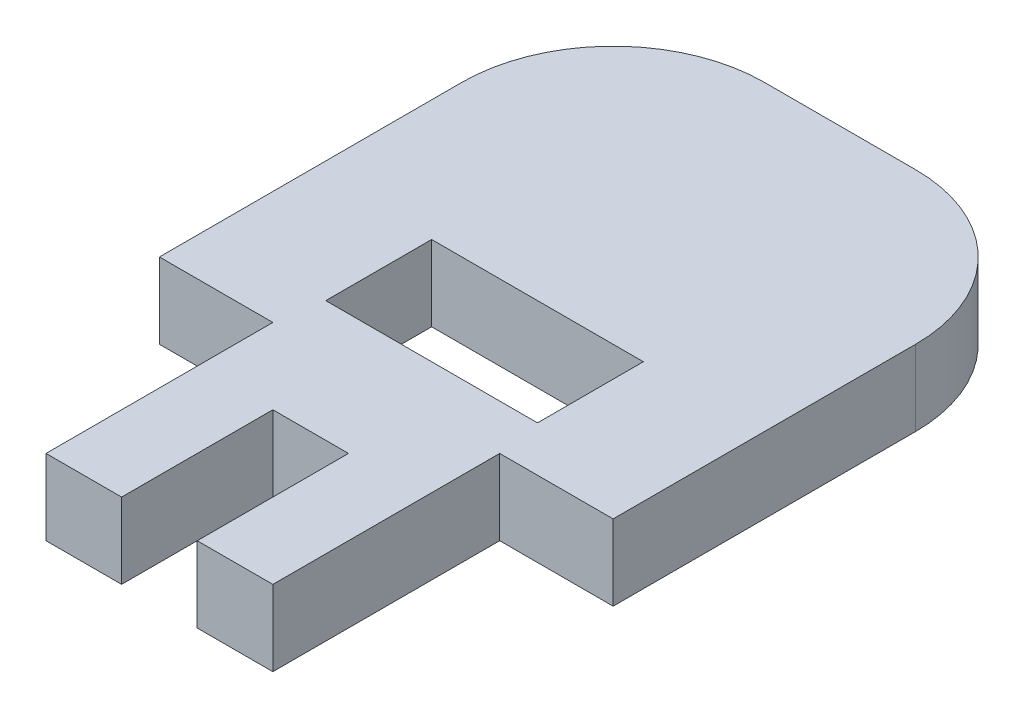
ISO-10303-21;
HEADER;
FILE_DESCRIPTION(('STEP AP214'),'2;1');
FILE_NAME('part.step','',(''),(''),'','','');
FILE_SCHEMA(('AUTOMOTIVE_DESIGN { 1 0 10303 214 1 1 1 1 }'));
ENDSEC;
DATA;
#1=APPLICATION_CONTEXT('core data for automotive mechanical design processes');
#2=APPLICATION_PROTOCOL_DEFINITION('international standard','automotive_design',2000,#1);
#3=PRODUCT_CONTEXT('',#1,'mechanical');
#4=PRODUCT('Part','Part','',(#3));
#5=PRODUCT_RELATED_PRODUCT_CATEGORY('part','',(#4));
#6=PRODUCT_DEFINITION_FORMATION('','',#4);
#7=PRODUCT_DEFINITION_CONTEXT('part definition',#1,'design');
#8=PRODUCT_DEFINITION('design','',#6,#7);
#9=PRODUCT_DEFINITION_SHAPE('','',#8);
#10=(LENGTH_UNIT() NAMED_UNIT(*) SI_UNIT(.MILLI.,.METRE.));
#11=(NAMED_UNIT(*) PLANE_ANGLE_UNIT() SI_UNIT($,.RADIAN.));
#12=(NAMED_UNIT(*) SI_UNIT($,.STERADIAN.) SOLID_ANGLE_UNIT());
#13=UNCERTAINTY_MEASURE_WITH_UNIT(LENGTH_MEASURE(1.E-05),#10,'distance_accuracy_value','');
#14=(GEOMETRIC_REPRESENTATION_CONTEXT(3) GLOBAL_UNCERTAINTY_ASSIGNED_CONTEXT((#13)) GLOBAL_UNIT_ASSIGNED_CONTEXT((#10,
#11,#12)) REPRESENTATION_CONTEXT('',''));
#15=CARTESIAN_POINT('',(0.,0.,0.));
#16=DIRECTION('',(0.,0.,1.));
#17=DIRECTION('',(1.,0.,0.));
#18=AXIS2_PLACEMENT_3D('',#15,#16,#17);
#19=CARTESIAN_POINT('',(9.525,6.35,3.175));
#20=DIRECTION('',(0.,0.,-1.));
#21=DIRECTION('',(-1.,0.,0.));
#22=AXIS2_PLACEMENT_3D('',#19,#20,#21);
#23=PLANE('',#22);
#24=DIRECTION('',(0.,-1.,0.));
#25=VECTOR('',#24,1.);
#26=CARTESIAN_POINT('',(3.17499999999999,6.35,3.175));
#27=LINE('',#26,#25);
#28=CARTESIAN_POINT('',(3.17499999999999,6.35,3.175));
#29=VERTEX_POINT('',#28);
#30=CARTESIAN_POINT('',(3.17499999999999,0.,3.175));
#31=VERTEX_POINT('',#30);
#32=EDGE_CURVE('E49',#29,#31,#27,.T.);
#33=ORIENTED_EDGE('',*,*,#32,.F.);
#34=DIRECTION('',(1.,0.,0.));
#35=VECTOR('',#34,1.);
#36=CARTESIAN_POINT('',(9.525,6.35,3.175));
#37=LINE('',#36,#35);
#38=CARTESIAN_POINT('',(-3.175,6.35,3.175));
#39=VERTEX_POINT('',#38);
#40=EDGE_CURVE('E166',#39,#29,#37,.T.);
#41=ORIENTED_EDGE('',*,*,#40,.F.);
#42=DIRECTION('',(0.,1.,0.));
#43=VECTOR('',#42,1.);
#44=CARTESIAN_POINT('',(-3.175,6.35,3.175));
#45=LINE('',#44,#43);
#46=CARTESIAN_POINT('',(-3.175,0.,3.175));
#47=VERTEX_POINT('',#46);
#48=EDGE_CURVE('E191',#47,#39,#45,.T.);
#49=ORIENTED_EDGE('',*,*,#48,.F.);
#50=DIRECTION('',(1.,0.,0.));
#51=VECTOR('',#50,1.);
#52=CARTESIAN_POINT('',(9.525,0.,3.175));
#53=LINE('',#52,#51);
#54=EDGE_CURVE('E54',#47,#31,#53,.T.);
#55=ORIENTED_EDGE('',*,*,#54,.T.);
#56=EDGE_LOOP('',(#33,#41,#49,#55));
#57=FACE_BOUND('',#56,.T.);
#58=ADVANCED_FACE('F34',(#57),#23,.F.);
#59=CARTESIAN_POINT('',(-19.05,6.35,-3.175));
#60=DIRECTION('',(0.,0.,-1.));
#61=DIRECTION('',(-1.,0.,0.));
#62=AXIS2_PLACEMENT_3D('',#59,#60,#61);
#63=PLANE('',#62);
#64=DIRECTION('',(1.,0.,0.));
#65=VECTOR('',#64,1.);
#66=CARTESIAN_POINT('',(-19.05,0.,-3.175));
#67=LINE('',#66,#65);
#68=CARTESIAN_POINT('',(-19.05,0.,-3.175));
#69=VERTEX_POINT('',#68);
#70=CARTESIAN_POINT('',(-9.525,0.,-3.175));
#71=VERTEX_POINT('',#70);
#72=EDGE_CURVE('E235',#69,#71,#67,.T.);
#73=ORIENTED_EDGE('',*,*,#72,.T.);
#74=DIRECTION('',(0.,-1.,0.));
#75=VECTOR('',#74,1.);
#76=CARTESIAN_POINT('',(-9.525,6.35,-3.175));
#77=LINE('',#76,#75);
#78=CARTESIAN_POINT('',(-9.525,6.35,-3.175));
#79=VERTEX_POINT('',#78);
#80=EDGE_CURVE('E11',#79,#71,#77,.T.);
#81=ORIENTED_EDGE('',*,*,#80,.F.);
#82=DIRECTION('',(1.,0.,0.));
#83=VECTOR('',#82,1.);
#84=CARTESIAN_POINT('',(-19.05,6.35,-3.175));
#85=LINE('',#84,#83);
#86=CARTESIAN_POINT('',(-19.05,6.35,-3.175));
#87=VERTEX_POINT('',#86);
#88=EDGE_CURVE('E242',#87,#79,#85,.T.);
#89=ORIENTED_EDGE('',*,*,#88,.F.);
#90=DIRECTION('',(0.,-1.,0.));
#91=VECTOR('',#90,1.);
#92=CARTESIAN_POINT('',(-19.05,6.35,-3.175));
#93=LINE('',#92,#91);
#94=EDGE_CURVE('E259',#87,#69,#93,.T.);
#95=ORIENTED_EDGE('',*,*,#94,.T.);
#96=EDGE_LOOP('',(#73,#81,#89,#95));
#97=FACE_BOUND('',#96,.T.);
#98=ADVANCED_FACE('F36',(#97),#63,.F.);
#99=CARTESIAN_POINT('',(-9.525,6.35,3.175));
#100=DIRECTION('',(1.,0.,0.));
#101=DIRECTION('',(0.,0.,-1.));
#102=AXIS2_PLACEMENT_3D('',#99,#100,#101);
#103=PLANE('',#102);
#104=DIRECTION('',(0.,0.,1.));
#105=VECTOR('',#104,1.);
#106=CARTESIAN_POINT('',(-9.525,0.,3.175));
#107=LINE('',#106,#105);
#108=CARTESIAN_POINT('',(-9.525,0.,15.875));
#109=VERTEX_POINT('',#108);
#110=EDGE_CURVE('E262',#71,#109,#107,.T.);
#111=ORIENTED_EDGE('',*,*,#110,.T.);
#112=DIRECTION('',(0.,-1.,0.));
#113=VECTOR('',#112,1.);
#114=CARTESIAN_POINT('',(-9.525,6.35,15.875));
#115=LINE('',#114,#113);
#116=CARTESIAN_POINT('',(-9.525,6.35,15.875));
#117=VERTEX_POINT('',#116);
#118=EDGE_CURVE('E192',#117,#109,#115,.T.);
#119=ORIENTED_EDGE('',*,*,#118,.F.);
#120=DIRECTION('',(0.,0.,1.));
#121=VECTOR('',#120,1.);
#122=CARTESIAN_POINT('',(-9.525,6.35,3.175));
#123=LINE('',#122,#121);
#124=EDGE_CURVE('E244',#79,#117,#123,.T.);
#125=ORIENTED_EDGE('',*,*,#124,.F.);
#126=ORIENTED_EDGE('',*,*,#80,.T.);
#127=EDGE_LOOP('',(#111,#119,#125,#126));
#128=FACE_BOUND('',#127,.T.);
#129=ADVANCED_FACE('F331',(#128),#103,.F.);
#130=CARTESIAN_POINT('',(9.525,6.35,3.175));
#131=DIRECTION('',(-1.,0.,0.));
#132=DIRECTION('',(0.,0.,1.));
#133=AXIS2_PLACEMENT_3D('',#130,#131,#132);
#134=PLANE('',#133);
#135=DIRECTION('',(0.,0.,-1.));
#136=VECTOR('',#135,1.);
#137=CARTESIAN_POINT('',(9.525,0.,3.175));
#138=LINE('',#137,#136);
#139=CARTESIAN_POINT('',(9.52499999999999,0.,15.875));
#140=VERTEX_POINT('',#139);
#141=CARTESIAN_POINT('',(9.525,0.,-3.175));
#142=VERTEX_POINT('',#141);
#143=EDGE_CURVE('E265',#140,#142,#138,.T.);
#144=ORIENTED_EDGE('',*,*,#143,.T.);
#145=DIRECTION('',(0.,-1.,0.));
#146=VECTOR('',#145,1.);
#147=CARTESIAN_POINT('',(9.525,6.35,-3.175));
#148=LINE('',#147,#146);
#149=CARTESIAN_POINT('',(9.525,6.35,-3.175));
#150=VERTEX_POINT('',#149);
#151=EDGE_CURVE('E42',#150,#142,#148,.T.);
#152=ORIENTED_EDGE('',*,*,#151,.F.);
#153=DIRECTION('',(0.,0.,-1.));
#154=VECTOR('',#153,1.);
#155=CARTESIAN_POINT('',(9.525,6.35,3.175));
#156=LINE('',#155,#154);
#157=CARTESIAN_POINT('',(9.52499999999999,6.35,15.875));
#158=VERTEX_POINT('',#157);
#159=EDGE_CURVE('E157',#158,#150,#156,.T.);
#160=ORIENTED_EDGE('',*,*,#159,.F.);
#161=DIRECTION('',(0.,1.,0.));
#162=VECTOR('',#161,1.);
#163=CARTESIAN_POINT('',(9.52499999999999,6.35,15.875));
#164=LINE('',#163,#162);
#165=EDGE_CURVE('E161',#140,#158,#164,.T.);
#166=ORIENTED_EDGE('',*,*,#165,.F.);
#167=EDGE_LOOP('',(#144,#152,#160,#166));
#168=FACE_BOUND('',#167,.T.);
#169=ADVANCED_FACE('F159',(#168),#134,.F.);
#170=CARTESIAN_POINT('',(9.525,6.35,-3.175));
#171=DIRECTION('',(0.,0.,-1.));
#172=DIRECTION('',(-1.,0.,0.));
#173=AXIS2_PLACEMENT_3D('',#170,#171,#172);
#174=PLANE('',#173);
#175=DIRECTION('',(1.,0.,0.));
#176=VECTOR('',#175,1.);
#177=CARTESIAN_POINT('',(9.525,0.,-3.175));
#178=LINE('',#177,#176);
#179=CARTESIAN_POINT('',(19.05,0.,-3.17500000000001));
#180=VERTEX_POINT('',#179);
#181=EDGE_CURVE('E267',#142,#180,#178,.T.);
#182=ORIENTED_EDGE('',*,*,#181,.T.);
#183=DIRECTION('',(0.,-1.,0.));
#184=VECTOR('',#183,1.);
#185=CARTESIAN_POINT('',(19.05,6.35,-3.17500000000001));
#186=LINE('',#185,#184);
#187=CARTESIAN_POINT('',(19.05,6.35,-3.17500000000001));
#188=VERTEX_POINT('',#187);
#189=EDGE_CURVE('E292',#188,#180,#186,.T.);
#190=ORIENTED_EDGE('',*,*,#189,.F.);
#191=DIRECTION('',(1.,0.,0.));
#192=VECTOR('',#191,1.);
#193=CARTESIAN_POINT('',(9.525,6.35,-3.175));
#194=LINE('',#193,#192);
#195=EDGE_CURVE('E165',#150,#188,#194,.T.);
#196=ORIENTED_EDGE('',*,*,#195,.F.);
#197=ORIENTED_EDGE('',*,*,#151,.T.);
#198=EDGE_LOOP('',(#182,#190,#196,#197));
#199=FACE_BOUND('',#198,.T.);
#200=ADVANCED_FACE('F296',(#199),#174,.F.);
#201=CARTESIAN_POINT('',(19.05,6.35,-3.17500000000001));
#202=DIRECTION('',(-1.,0.,0.));
#203=DIRECTION('',(0.,0.,1.));
#204=AXIS2_PLACEMENT_3D('',#201,#202,#203);
#205=PLANE('',#204);
#206=DIRECTION('',(0.,0.,-1.));
#207=VECTOR('',#206,1.);
#208=CARTESIAN_POINT('',(19.05,0.,-3.17500000000001));
#209=LINE('',#208,#207);
#210=CARTESIAN_POINT('',(19.05,0.,-28.575));
#211=VERTEX_POINT('',#210);
#212=EDGE_CURVE('E269',#180,#211,#209,.T.);
#213=ORIENTED_EDGE('',*,*,#212,.T.);
#214=DIRECTION('',(0.,-1.,0.));
#215=VECTOR('',#214,1.);
#216=CARTESIAN_POINT('',(19.05,6.35,-28.575));
#217=LINE('',#216,#215);
#218=CARTESIAN_POINT('',(19.05,6.35,-28.575));
#219=VERTEX_POINT('',#218);
#220=EDGE_CURVE('E289',#219,#211,#217,.T.);
#221=ORIENTED_EDGE('',*,*,#220,.F.);
#222=DIRECTION('',(0.,0.,-1.));
#223=VECTOR('',#222,1.);
#224=CARTESIAN_POINT('',(19.05,6.35,-3.17500000000001));
#225=LINE('',#224,#223);
#226=EDGE_CURVE('E249',#188,#219,#225,.T.);
#227=ORIENTED_EDGE('',*,*,#226,.F.);
#228=ORIENTED_EDGE('',*,*,#189,.T.);
#229=EDGE_LOOP('',(#213,#221,#227,#228));
#230=FACE_BOUND('',#229,.T.);
#231=ADVANCED_FACE('F306',(#230),#205,.F.);
#232=CARTESIAN_POINT('',(6.35000000000002,6.35,-28.575));
#233=DIRECTION('',(0.,-1.,0.));
#234=DIRECTION('',(0.,0.,-1.));
#235=AXIS2_PLACEMENT_3D('',#232,#233,#234);
#236=CYLINDRICAL_SURFACE('',#235,12.7);
#237=CARTESIAN_POINT('',(6.35000000000002,0.,-28.575));
#238=DIRECTION('',(0.,1.,0.));
#239=DIRECTION('',(0.,0.,-1.));
#240=AXIS2_PLACEMENT_3D('',#237,#238,#239);
#241=CIRCLE('',#240,12.7);
#242=CARTESIAN_POINT('',(6.35000000000001,0.,-41.275));
#243=VERTEX_POINT('',#242);
#244=EDGE_CURVE('E271',#211,#243,#241,.T.);
#245=ORIENTED_EDGE('',*,*,#244,.T.);
#246=DIRECTION('',(0.,-1.,0.));
#247=VECTOR('',#246,1.);
#248=CARTESIAN_POINT('',(6.35000000000001,6.35,-41.275));
#249=LINE('',#248,#247);
#250=CARTESIAN_POINT('',(6.35000000000001,6.35,-41.275));
#251=VERTEX_POINT('',#250);
#252=EDGE_CURVE('E286',#251,#243,#249,.T.);
#253=ORIENTED_EDGE('',*,*,#252,.F.);
#254=CARTESIAN_POINT('',(6.35000000000002,6.35,-28.575));
#255=DIRECTION('',(0.,1.,0.));
#256=DIRECTION('',(0.,0.,-1.));
#257=AXIS2_PLACEMENT_3D('',#254,#255,#256);
#258=CIRCLE('',#257,12.7);
#259=EDGE_CURVE('E251',#219,#251,#258,.T.);
#260=ORIENTED_EDGE('',*,*,#259,.F.);
#261=ORIENTED_EDGE('',*,*,#220,.T.);
#262=EDGE_LOOP('',(#245,#253,#260,#261));
#263=FACE_BOUND('',#262,.T.);
#264=ADVANCED_FACE('F310',(#263),#236,.T.);
#265=CARTESIAN_POINT('',(-6.35000000000002,6.35,-41.275));
#266=DIRECTION('',(0.,0.,1.));
#267=DIRECTION('',(1.,0.,0.));
#268=AXIS2_PLACEMENT_3D('',#265,#266,#267);
#269=PLANE('',#268);
#270=DIRECTION('',(-1.,0.,0.));
#271=VECTOR('',#270,1.);
#272=CARTESIAN_POINT('',(-6.35000000000002,0.,-41.275));
#273=LINE('',#272,#271);
#274=CARTESIAN_POINT('',(-6.35000000000002,0.,-41.275));
#275=VERTEX_POINT('',#274);
#276=EDGE_CURVE('E273',#243,#275,#273,.T.);
#277=ORIENTED_EDGE('',*,*,#276,.T.);
#278=DIRECTION('',(0.,-1.,0.));
#279=VECTOR('',#278,1.);
#280=CARTESIAN_POINT('',(-6.35000000000002,6.35,-41.275));
#281=LINE('',#280,#279);
#282=CARTESIAN_POINT('',(-6.35000000000002,6.35,-41.275));
#283=VERTEX_POINT('',#282);
#284=EDGE_CURVE('E283',#283,#275,#281,.T.);
#285=ORIENTED_EDGE('',*,*,#284,.F.);
#286=DIRECTION('',(-1.,0.,0.));
#287=VECTOR('',#286,1.);
#288=CARTESIAN_POINT('',(-6.35000000000002,6.35,-41.275));
#289=LINE('',#288,#287);
#290=EDGE_CURVE('E253',#251,#283,#289,.T.);
#291=ORIENTED_EDGE('',*,*,#290,.F.);
#292=ORIENTED_EDGE('',*,*,#252,.T.);
#293=EDGE_LOOP('',(#277,#285,#291,#292));
#294=FACE_BOUND('',#293,.T.);
#295=ADVANCED_FACE('F317',(#294),#269,.F.);
#296=CARTESIAN_POINT('',(-6.35000000000002,6.35,-28.575));
#297=DIRECTION('',(0.,-1.,0.));
#298=DIRECTION('',(0.,0.,-1.));
#299=AXIS2_PLACEMENT_3D('',#296,#297,#298);
#300=CYLINDRICAL_SURFACE('',#299,12.7);
#301=CARTESIAN_POINT('',(-6.35000000000002,0.,-28.575));
#302=DIRECTION('',(0.,1.,0.));
#303=DIRECTION('',(0.,0.,-1.));
#304=AXIS2_PLACEMENT_3D('',#301,#302,#303);
#305=CIRCLE('',#304,12.7);
#306=CARTESIAN_POINT('',(-19.05,0.,-28.575));
#307=VERTEX_POINT('',#306);
#308=EDGE_CURVE('E275',#275,#307,#305,.T.);
#309=ORIENTED_EDGE('',*,*,#308,.T.);
#310=DIRECTION('',(0.,-1.,0.));
#311=VECTOR('',#310,1.);
#312=CARTESIAN_POINT('',(-19.05,6.35,-28.575));
#313=LINE('',#312,#311);
#314=CARTESIAN_POINT('',(-19.05,6.35,-28.575));
#315=VERTEX_POINT('',#314);
#316=EDGE_CURVE('E280',#315,#307,#313,.T.);
#317=ORIENTED_EDGE('',*,*,#316,.F.);
#318=CARTESIAN_POINT('',(-6.35000000000002,6.35,-28.575));
#319=DIRECTION('',(0.,1.,0.));
#320=DIRECTION('',(0.,0.,-1.));
#321=AXIS2_PLACEMENT_3D('',#318,#319,#320);
#322=CIRCLE('',#321,12.7);
#323=EDGE_CURVE('E255',#283,#315,#322,.T.);
#324=ORIENTED_EDGE('',*,*,#323,.F.);
#325=ORIENTED_EDGE('',*,*,#284,.T.);
#326=EDGE_LOOP('',(#309,#317,#324,#325));
#327=FACE_BOUND('',#326,.T.);
#328=ADVANCED_FACE('F320',(#327),#300,.T.);
#329=CARTESIAN_POINT('',(-19.05,6.35,-3.175));
#330=DIRECTION('',(1.,0.,0.));
#331=DIRECTION('',(0.,0.,-1.));
#332=AXIS2_PLACEMENT_3D('',#329,#330,#331);
#333=PLANE('',#332);
#334=DIRECTION('',(0.,0.,1.));
#335=VECTOR('',#334,1.);
#336=CARTESIAN_POINT('',(-19.05,0.,-3.175));
#337=LINE('',#336,#335);
#338=EDGE_CURVE('E245',#307,#69,#337,.T.);
#339=ORIENTED_EDGE('',*,*,#338,.T.);
#340=ORIENTED_EDGE('',*,*,#94,.F.);
#341=DIRECTION('',(0.,0.,1.));
#342=VECTOR('',#341,1.);
#343=CARTESIAN_POINT('',(-19.05,6.35,-3.175));
#344=LINE('',#343,#342);
#345=EDGE_CURVE('E257',#315,#87,#344,.T.);
#346=ORIENTED_EDGE('',*,*,#345,.F.);
#347=ORIENTED_EDGE('',*,*,#316,.T.);
#348=EDGE_LOOP('',(#339,#340,#346,#347));
#349=FACE_BOUND('',#348,.T.);
#350=ADVANCED_FACE('F325',(#349),#333,.F.);
#351=CARTESIAN_POINT('',(6.35000000000002,6.35,-28.575));
#352=DIRECTION('',(0.,-1.,0.));
#353=DIRECTION('',(0.,0.,-1.));
#354=AXIS2_PLACEMENT_3D('',#351,#352,#353);
#355=PLANE('',#354);
#356=DIRECTION('',(1.,0.,0.));
#357=VECTOR('',#356,1.);
#358=CARTESIAN_POINT('',(-8.88999999999999,6.35,-6.985));
#359=LINE('',#358,#357);
#360=CARTESIAN_POINT('',(-8.88999999999999,6.35,-6.985));
#361=VERTEX_POINT('',#360);
#362=CARTESIAN_POINT('',(8.89000000000001,6.35,-6.985));
#363=VERTEX_POINT('',#362);
#364=EDGE_CURVE('E225',#361,#363,#359,.T.);
#365=ORIENTED_EDGE('',*,*,#364,.F.);
#366=DIRECTION('',(0.,0.,1.));
#367=VECTOR('',#366,1.);
#368=CARTESIAN_POINT('',(-8.88999999999999,6.35,-15.875));
#369=LINE('',#368,#367);
#370=CARTESIAN_POINT('',(-8.88999999999999,6.35,-15.875));
#371=VERTEX_POINT('',#370);
#372=EDGE_CURVE('E210',#371,#361,#369,.T.);
#373=ORIENTED_EDGE('',*,*,#372,.F.);
#374=DIRECTION('',(1.,0.,0.));
#375=VECTOR('',#374,1.);
#376=CARTESIAN_POINT('',(-8.88999999999999,6.35,-15.875));
#377=LINE('',#376,#375);
#378=CARTESIAN_POINT('',(8.89000000000001,6.35,-15.875));
#379=VERTEX_POINT('',#378);
#380=EDGE_CURVE('E215',#371,#379,#377,.T.);
#381=ORIENTED_EDGE('',*,*,#380,.T.);
#382=DIRECTION('',(0.,0.,1.));
#383=VECTOR('',#382,1.);
#384=CARTESIAN_POINT('',(8.89000000000001,6.35,-15.875));
#385=LINE('',#384,#383);
#386=EDGE_CURVE('E228',#379,#363,#385,.T.);
#387=ORIENTED_EDGE('',*,*,#386,.T.);
#388=EDGE_LOOP('',(#365,#373,#381,#387));
#389=FACE_BOUND('',#388,.T.);
#390=ORIENTED_EDGE('',*,*,#88,.T.);
#391=ORIENTED_EDGE('',*,*,#124,.T.);
#392=DIRECTION('',(-1.,0.,0.));
#393=VECTOR('',#392,1.);
#394=CARTESIAN_POINT('',(-9.525,6.35,15.875));
#395=LINE('',#394,#393);
#396=CARTESIAN_POINT('',(-3.175,6.35,15.875));
#397=VERTEX_POINT('',#396);
#398=EDGE_CURVE('E199',#397,#117,#395,.T.);
#399=ORIENTED_EDGE('',*,*,#398,.F.);
#400=DIRECTION('',(0.,0.,-1.));
#401=VECTOR('',#400,1.);
#402=CARTESIAN_POINT('',(-3.175,6.35,15.875));
#403=LINE('',#402,#401);
#404=EDGE_CURVE('E202',#397,#39,#403,.T.);
#405=ORIENTED_EDGE('',*,*,#404,.T.);
#406=ORIENTED_EDGE('',*,*,#40,.T.);
#407=DIRECTION('',(0.,0.,-1.));
#408=VECTOR('',#407,1.);
#409=CARTESIAN_POINT('',(3.17499999999999,6.35,15.875));
#410=LINE('',#409,#408);
#411=CARTESIAN_POINT('',(3.17499999999999,6.35,15.875));
#412=VERTEX_POINT('',#411);
#413=EDGE_CURVE('E173',#412,#29,#410,.T.);
#414=ORIENTED_EDGE('',*,*,#413,.F.);
#415=DIRECTION('',(-1.,0.,0.));
#416=VECTOR('',#415,1.);
#417=CARTESIAN_POINT('',(9.52499999999999,6.35,15.875));
#418=LINE('',#417,#416);
#419=EDGE_CURVE('E169',#158,#412,#418,.T.);
#420=ORIENTED_EDGE('',*,*,#419,.F.);
#421=ORIENTED_EDGE('',*,*,#159,.T.);
#422=ORIENTED_EDGE('',*,*,#195,.T.);
#423=ORIENTED_EDGE('',*,*,#226,.T.);
#424=ORIENTED_EDGE('',*,*,#259,.T.);
#425=ORIENTED_EDGE('',*,*,#290,.T.);
#426=ORIENTED_EDGE('',*,*,#323,.T.);
#427=ORIENTED_EDGE('',*,*,#345,.T.);
#428=EDGE_LOOP('',(#390,#391,#399,#405,#406,#414,#420,#421,#422,#423,#424,#425,#426,#427));
#429=FACE_BOUND('',#428,.T.);
#430=ADVANCED_FACE('F171',(#389,#429),#355,.F.);
#431=CARTESIAN_POINT('',(6.35000000000002,0.,-28.575));
#432=DIRECTION('',(0.,-1.,0.));
#433=DIRECTION('',(0.,0.,-1.));
#434=AXIS2_PLACEMENT_3D('',#431,#432,#433);
#435=PLANE('',#434);
#436=DIRECTION('',(0.,0.,1.));
#437=VECTOR('',#436,1.);
#438=CARTESIAN_POINT('',(-8.88999999999999,0.,-15.875));
#439=LINE('',#438,#437);
#440=CARTESIAN_POINT('',(-8.88999999999999,0.,-15.875));
#441=VERTEX_POINT('',#440);
#442=CARTESIAN_POINT('',(-8.88999999999999,0.,-6.985));
#443=VERTEX_POINT('',#442);
#444=EDGE_CURVE('E211',#441,#443,#439,.T.);
#445=ORIENTED_EDGE('',*,*,#444,.T.);
#446=DIRECTION('',(1.,0.,0.));
#447=VECTOR('',#446,1.);
#448=CARTESIAN_POINT('',(-8.88999999999999,0.,-6.985));
#449=LINE('',#448,#447);
#450=CARTESIAN_POINT('',(8.89000000000001,0.,-6.985));
#451=VERTEX_POINT('',#450);
#452=EDGE_CURVE('E214',#443,#451,#449,.T.);
#453=ORIENTED_EDGE('',*,*,#452,.T.);
#454=DIRECTION('',(0.,0.,1.));
#455=VECTOR('',#454,1.);
#456=CARTESIAN_POINT('',(8.89000000000001,0.,-15.875));
#457=LINE('',#456,#455);
#458=CARTESIAN_POINT('',(8.89000000000001,0.,-15.875));
#459=VERTEX_POINT('',#458);
#460=EDGE_CURVE('E218',#459,#451,#457,.T.);
#461=ORIENTED_EDGE('',*,*,#460,.F.);
#462=DIRECTION('',(1.,0.,0.));
#463=VECTOR('',#462,1.);
#464=CARTESIAN_POINT('',(-8.88999999999999,0.,-15.875));
#465=LINE('',#464,#463);
#466=EDGE_CURVE('E221',#441,#459,#465,.T.);
#467=ORIENTED_EDGE('',*,*,#466,.F.);
#468=EDGE_LOOP('',(#445,#453,#461,#467));
#469=FACE_BOUND('',#468,.T.);
#470=ORIENTED_EDGE('',*,*,#72,.F.);
#471=ORIENTED_EDGE('',*,*,#338,.F.);
#472=ORIENTED_EDGE('',*,*,#308,.F.);
#473=ORIENTED_EDGE('',*,*,#276,.F.);
#474=ORIENTED_EDGE('',*,*,#244,.F.);
#475=ORIENTED_EDGE('',*,*,#212,.F.);
#476=ORIENTED_EDGE('',*,*,#181,.F.);
#477=ORIENTED_EDGE('',*,*,#143,.F.);
#478=DIRECTION('',(1.,0.,0.));
#479=VECTOR('',#478,1.);
#480=CARTESIAN_POINT('',(9.52499999999999,0.,15.875));
#481=LINE('',#480,#479);
#482=CARTESIAN_POINT('',(3.17499999999999,0.,15.875));
#483=VERTEX_POINT('',#482);
#484=EDGE_CURVE('E181',#483,#140,#481,.T.);
#485=ORIENTED_EDGE('',*,*,#484,.F.);
#486=DIRECTION('',(0.,0.,-1.));
#487=VECTOR('',#486,1.);
#488=CARTESIAN_POINT('',(3.17499999999999,0.,15.875));
#489=LINE('',#488,#487);
#490=EDGE_CURVE('E186',#483,#31,#489,.T.);
#491=ORIENTED_EDGE('',*,*,#490,.T.);
#492=ORIENTED_EDGE('',*,*,#54,.F.);
#493=DIRECTION('',(0.,0.,-1.));
#494=VECTOR('',#493,1.);
#495=CARTESIAN_POINT('',(-3.175,0.,15.875));
#496=LINE('',#495,#494);
#497=CARTESIAN_POINT('',(-3.175,0.,15.875));
#498=VERTEX_POINT('',#497);
#499=EDGE_CURVE('E207',#498,#47,#496,.T.);
#500=ORIENTED_EDGE('',*,*,#499,.F.);
#501=DIRECTION('',(1.,0.,0.));
#502=VECTOR('',#501,1.);
#503=CARTESIAN_POINT('',(-9.525,0.,15.875));
#504=LINE('',#503,#502);
#505=EDGE_CURVE('E195',#109,#498,#504,.T.);
#506=ORIENTED_EDGE('',*,*,#505,.F.);
#507=ORIENTED_EDGE('',*,*,#110,.F.);
#508=EDGE_LOOP('',(#470,#471,#472,#473,#474,#475,#476,#477,#485,#491,#492,#500,#506,#507));
#509=FACE_BOUND('',#508,.T.);
#510=ADVANCED_FACE('F301',(#469,#509),#435,.T.);
#511=CARTESIAN_POINT('',(-8.88999999999999,0.,-15.875));
#512=DIRECTION('',(-1.,0.,0.));
#513=DIRECTION('',(0.,0.,1.));
#514=AXIS2_PLACEMENT_3D('',#511,#512,#513);
#515=PLANE('',#514);
#516=ORIENTED_EDGE('',*,*,#372,.T.);
#517=DIRECTION('',(0.,1.,0.));
#518=VECTOR('',#517,1.);
#519=CARTESIAN_POINT('',(-8.88999999999999,0.,-6.985));
#520=LINE('',#519,#518);
#521=EDGE_CURVE('E223',#443,#361,#520,.T.);
#522=ORIENTED_EDGE('',*,*,#521,.F.);
#523=ORIENTED_EDGE('',*,*,#444,.F.);
#524=DIRECTION('',(0.,1.,0.));
#525=VECTOR('',#524,1.);
#526=CARTESIAN_POINT('',(-8.88999999999999,0.,-15.875));
#527=LINE('',#526,#525);
#528=EDGE_CURVE('E233',#441,#371,#527,.T.);
#529=ORIENTED_EDGE('',*,*,#528,.T.);
#530=EDGE_LOOP('',(#516,#522,#523,#529));
#531=FACE_BOUND('',#530,.T.);
#532=ADVANCED_FACE('F381',(#531),#515,.F.);
#533=CARTESIAN_POINT('',(-8.88999999999999,0.,-15.875));
#534=DIRECTION('',(0.,0.,1.));
#535=DIRECTION('',(1.,0.,0.));
#536=AXIS2_PLACEMENT_3D('',#533,#534,#535);
#537=PLANE('',#536);
#538=ORIENTED_EDGE('',*,*,#380,.F.);
#539=ORIENTED_EDGE('',*,*,#528,.F.);
#540=ORIENTED_EDGE('',*,*,#466,.T.);
#541=DIRECTION('',(0.,1.,0.));
#542=VECTOR('',#541,1.);
#543=CARTESIAN_POINT('',(8.89000000000001,0.,-15.875));
#544=LINE('',#543,#542);
#545=EDGE_CURVE('E236',#459,#379,#544,.T.);
#546=ORIENTED_EDGE('',*,*,#545,.T.);
#547=EDGE_LOOP('',(#538,#539,#540,#546));
#548=FACE_BOUND('',#547,.T.);
#549=ADVANCED_FACE('F388',(#548),#537,.T.);
#550=CARTESIAN_POINT('',(8.89000000000001,0.,-15.875));
#551=DIRECTION('',(-1.,0.,0.));
#552=DIRECTION('',(0.,0.,1.));
#553=AXIS2_PLACEMENT_3D('',#550,#551,#552);
#554=PLANE('',#553);
#555=ORIENTED_EDGE('',*,*,#386,.F.);
#556=ORIENTED_EDGE('',*,*,#545,.F.);
#557=ORIENTED_EDGE('',*,*,#460,.T.);
#558=DIRECTION('',(0.,1.,0.));
#559=VECTOR('',#558,1.);
#560=CARTESIAN_POINT('',(8.89000000000001,0.,-6.985));
#561=LINE('',#560,#559);
#562=EDGE_CURVE('E238',#451,#363,#561,.T.);
#563=ORIENTED_EDGE('',*,*,#562,.T.);
#564=EDGE_LOOP('',(#555,#556,#557,#563));
#565=FACE_BOUND('',#564,.T.);
#566=ADVANCED_FACE('F393',(#565),#554,.T.);
#567=CARTESIAN_POINT('',(-8.88999999999999,0.,-6.985));
#568=DIRECTION('',(0.,0.,1.));
#569=DIRECTION('',(1.,0.,0.));
#570=AXIS2_PLACEMENT_3D('',#567,#568,#569);
#571=PLANE('',#570);
#572=ORIENTED_EDGE('',*,*,#364,.T.);
#573=ORIENTED_EDGE('',*,*,#562,.F.);
#574=ORIENTED_EDGE('',*,*,#452,.F.);
#575=ORIENTED_EDGE('',*,*,#521,.T.);
#576=EDGE_LOOP('',(#572,#573,#574,#575));
#577=FACE_BOUND('',#576,.T.);
#578=ADVANCED_FACE('F390',(#577),#571,.F.);
#579=CARTESIAN_POINT('',(-3.175,6.35,15.875));
#580=DIRECTION('',(-1.,0.,0.));
#581=DIRECTION('',(0.,-1.,0.));
#582=AXIS2_PLACEMENT_3D('',#579,#580,#581);
#583=PLANE('',#582);
#584=ORIENTED_EDGE('',*,*,#48,.T.);
#585=ORIENTED_EDGE('',*,*,#404,.F.);
#586=DIRECTION('',(0.,1.,0.));
#587=VECTOR('',#586,1.);
#588=CARTESIAN_POINT('',(-3.175,6.35,15.875));
#589=LINE('',#588,#587);
#590=EDGE_CURVE('E197',#498,#397,#589,.T.);
#591=ORIENTED_EDGE('',*,*,#590,.F.);
#592=ORIENTED_EDGE('',*,*,#499,.T.);
#593=EDGE_LOOP('',(#584,#585,#591,#592));
#594=FACE_BOUND('',#593,.T.);
#595=ADVANCED_FACE('F340',(#594),#583,.F.);
#596=CARTESIAN_POINT('',(0.,0.,15.875));
#597=DIRECTION('',(0.,0.,1.));
#598=DIRECTION('',(1.,0.,0.));
#599=AXIS2_PLACEMENT_3D('',#596,#597,#598);
#600=PLANE('',#599);
#601=ORIENTED_EDGE('',*,*,#118,.T.);
#602=ORIENTED_EDGE('',*,*,#505,.T.);
#603=ORIENTED_EDGE('',*,*,#590,.T.);
#604=ORIENTED_EDGE('',*,*,#398,.T.);
#605=EDGE_LOOP('',(#601,#602,#603,#604));
#606=FACE_BOUND('',#605,.T.);
#607=ADVANCED_FACE('F335',(#606),#600,.T.);
#608=CARTESIAN_POINT('',(3.17499999999999,6.35,15.875));
#609=DIRECTION('',(1.,0.,0.));
#610=DIRECTION('',(0.,1.,0.));
#611=AXIS2_PLACEMENT_3D('',#608,#609,#610);
#612=PLANE('',#611);
#613=ORIENTED_EDGE('',*,*,#32,.T.);
#614=ORIENTED_EDGE('',*,*,#490,.F.);
#615=DIRECTION('',(0.,-1.,0.));
#616=VECTOR('',#615,1.);
#617=CARTESIAN_POINT('',(3.17499999999999,6.35,15.875));
#618=LINE('',#617,#616);
#619=EDGE_CURVE('E176',#412,#483,#618,.T.);
#620=ORIENTED_EDGE('',*,*,#619,.F.);
#621=ORIENTED_EDGE('',*,*,#413,.T.);
#622=EDGE_LOOP('',(#613,#614,#620,#621));
#623=FACE_BOUND('',#622,.T.);
#624=ADVANCED_FACE('F343',(#623),#612,.F.);
#625=CARTESIAN_POINT('',(0.,0.,15.875));
#626=DIRECTION('',(0.,0.,-1.));
#627=DIRECTION('',(-1.,0.,0.));
#628=AXIS2_PLACEMENT_3D('',#625,#626,#627);
#629=PLANE('',#628);
#630=ORIENTED_EDGE('',*,*,#165,.T.);
#631=ORIENTED_EDGE('',*,*,#419,.T.);
#632=ORIENTED_EDGE('',*,*,#619,.T.);
#633=ORIENTED_EDGE('',*,*,#484,.T.);
#634=EDGE_LOOP('',(#630,#631,#632,#633));
#635=FACE_BOUND('',#634,.T.);
#636=ADVANCED_FACE('F179',(#635),#629,.F.);
#637=CLOSED_SHELL('',(#58,#98,#129,#169,#200,#231,#264,#295,#328,#350,#430,#510,#532,#549,#566,
#578,#595,#607,#624,#636));
#638=MANIFOLD_SOLID_BREP('B2',#637);
#639=ADVANCED_BREP_SHAPE_REPRESENTATION('',(#18,#638),#14);
#640=SHAPE_DEFINITION_REPRESENTATION(#9,#639);
ENDSEC;
END-ISO-10303-21;
